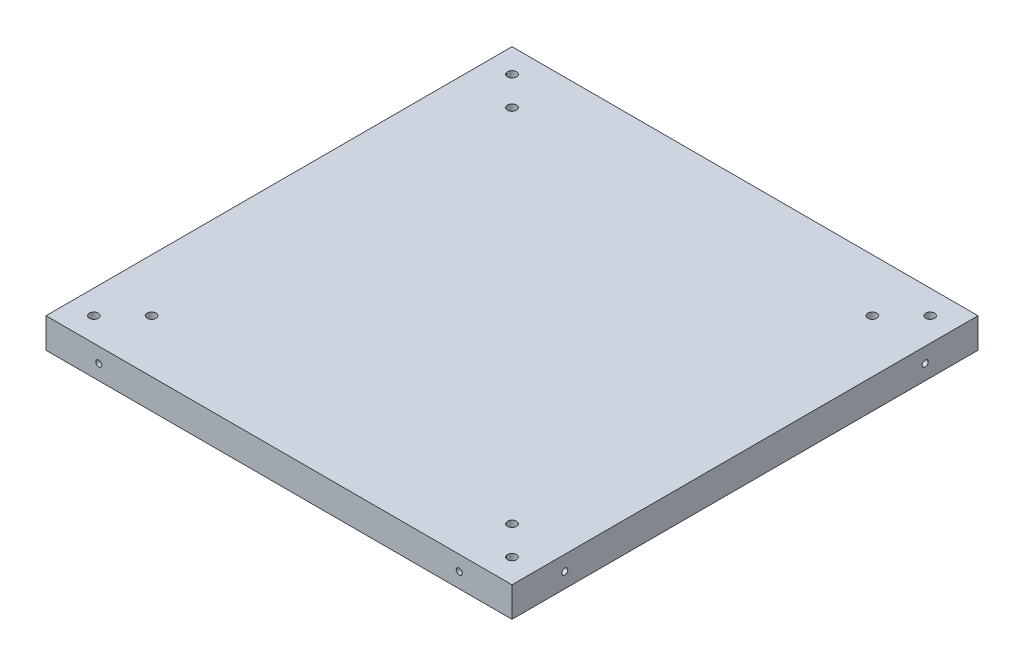
ISO-10303-21;
HEADER;
FILE_DESCRIPTION(('STEP AP214'),'2;1');
FILE_NAME('part.step','',(''),(''),'','','');
FILE_SCHEMA(('AUTOMOTIVE_DESIGN { 1 0 10303 214 1 1 1 1 }'));
ENDSEC;
DATA;
#1=APPLICATION_CONTEXT('core data for automotive mechanical design processes');
#2=APPLICATION_PROTOCOL_DEFINITION('international standard','automotive_design',2000,#1);
#3=PRODUCT_CONTEXT('',#1,'mechanical');
#4=PRODUCT('Part','Part','',(#3));
#5=PRODUCT_RELATED_PRODUCT_CATEGORY('part','',(#4));
#6=PRODUCT_DEFINITION_FORMATION('','',#4);
#7=PRODUCT_DEFINITION_CONTEXT('part definition',#1,'design');
#8=PRODUCT_DEFINITION('design','',#6,#7);
#9=PRODUCT_DEFINITION_SHAPE('','',#8);
#10=(LENGTH_UNIT() NAMED_UNIT(*) SI_UNIT(.MILLI.,.METRE.));
#11=(NAMED_UNIT(*) PLANE_ANGLE_UNIT() SI_UNIT($,.RADIAN.));
#12=(NAMED_UNIT(*) SI_UNIT($,.STERADIAN.) SOLID_ANGLE_UNIT());
#13=UNCERTAINTY_MEASURE_WITH_UNIT(LENGTH_MEASURE(1.E-05),#10,'distance_accuracy_value','');
#14=(GEOMETRIC_REPRESENTATION_CONTEXT(3) GLOBAL_UNCERTAINTY_ASSIGNED_CONTEXT((#13)) GLOBAL_UNIT_ASSIGNED_CONTEXT((#10,
#11,#12)) REPRESENTATION_CONTEXT('',''));
#15=CARTESIAN_POINT('',(0.,0.,0.));
#16=DIRECTION('',(0.,0.,1.));
#17=DIRECTION('',(1.,0.,0.));
#18=AXIS2_PLACEMENT_3D('',#15,#16,#17);
#19=CARTESIAN_POINT('',(-60.6043265364737,20.,60.474138119506));
#20=DIRECTION('',(0.,-1.,0.));
#21=DIRECTION('',(0.,0.,-1.));
#22=AXIS2_PLACEMENT_3D('',#19,#20,#21);
#23=CYLINDRICAL_SURFACE('',#22,1.5);
#24=CARTESIAN_POINT('',(-60.6043265364737,3.,60.474138119506));
#25=DIRECTION('',(0.,-1.,0.));
#26=DIRECTION('',(0.,0.,-1.));
#27=AXIS2_PLACEMENT_3D('',#24,#25,#26);
#28=CIRCLE('',#27,1.5);
#29=CARTESIAN_POINT('',(-60.6043265364737,3.,58.974138119506));
#30=VERTEX_POINT('',#29);
#31=EDGE_CURVE('E48',#30,#30,#28,.T.);
#32=ORIENTED_EDGE('',*,*,#31,.T.);
#33=EDGE_LOOP('',(#32));
#34=FACE_BOUND('',#33,.T.);
#35=CARTESIAN_POINT('',(-60.6043265364737,10.,60.474138119506));
#36=DIRECTION('',(0.,1.,0.));
#37=DIRECTION('',(0.,0.,1.));
#38=AXIS2_PLACEMENT_3D('',#35,#36,#37);
#39=CIRCLE('',#38,1.5);
#40=CARTESIAN_POINT('',(-60.6043265364737,10.,61.974138119506));
#41=VERTEX_POINT('',#40);
#42=EDGE_CURVE('E249',#41,#41,#39,.T.);
#43=ORIENTED_EDGE('',*,*,#42,.T.);
#44=EDGE_LOOP('',(#43));
#45=FACE_BOUND('',#44,.T.);
#46=ADVANCED_FACE('F44',(#34,#45),#23,.F.);
#47=CARTESIAN_POINT('',(-60.6043265364737,20.,-59.9533844516352));
#48=DIRECTION('',(0.,-1.,0.));
#49=DIRECTION('',(0.,0.,-1.));
#50=AXIS2_PLACEMENT_3D('',#47,#48,#49);
#51=CYLINDRICAL_SURFACE('',#50,1.5);
#52=CARTESIAN_POINT('',(-60.6043265364737,3.,-59.9533844516352));
#53=DIRECTION('',(0.,-1.,0.));
#54=DIRECTION('',(0.,0.,-1.));
#55=AXIS2_PLACEMENT_3D('',#52,#53,#54);
#56=CIRCLE('',#55,1.5);
#57=CARTESIAN_POINT('',(-60.6043265364737,3.,-61.4533844516352));
#58=VERTEX_POINT('',#57);
#59=EDGE_CURVE('E127',#58,#58,#56,.T.);
#60=ORIENTED_EDGE('',*,*,#59,.T.);
#61=EDGE_LOOP('',(#60));
#62=FACE_BOUND('',#61,.T.);
#63=CARTESIAN_POINT('',(-60.6043265364737,10.,-59.9533844516352));
#64=DIRECTION('',(0.,1.,0.));
#65=DIRECTION('',(0.,0.,1.));
#66=AXIS2_PLACEMENT_3D('',#63,#64,#65);
#67=CIRCLE('',#66,1.5);
#68=CARTESIAN_POINT('',(-60.6043265364737,10.,-58.4533844516352));
#69=VERTEX_POINT('',#68);
#70=EDGE_CURVE('E246',#69,#69,#67,.T.);
#71=ORIENTED_EDGE('',*,*,#70,.T.);
#72=EDGE_LOOP('',(#71));
#73=FACE_BOUND('',#72,.T.);
#74=ADVANCED_FACE('F174',(#62,#73),#51,.F.);
#75=CARTESIAN_POINT('',(59.8231960346675,20.,-59.9533844516352));
#76=DIRECTION('',(0.,-1.,0.));
#77=DIRECTION('',(0.,0.,-1.));
#78=AXIS2_PLACEMENT_3D('',#75,#76,#77);
#79=CYLINDRICAL_SURFACE('',#78,1.5);
#80=CARTESIAN_POINT('',(59.8231960346675,3.,-59.9533844516352));
#81=DIRECTION('',(0.,-1.,0.));
#82=DIRECTION('',(0.,0.,-1.));
#83=AXIS2_PLACEMENT_3D('',#80,#81,#82);
#84=CIRCLE('',#83,1.5);
#85=CARTESIAN_POINT('',(59.8231960346675,3.,-61.4533844516352));
#86=VERTEX_POINT('',#85);
#87=EDGE_CURVE('E124',#86,#86,#84,.T.);
#88=ORIENTED_EDGE('',*,*,#87,.T.);
#89=EDGE_LOOP('',(#88));
#90=FACE_BOUND('',#89,.T.);
#91=CARTESIAN_POINT('',(59.8231960346675,10.,-59.9533844516352));
#92=DIRECTION('',(0.,1.,0.));
#93=DIRECTION('',(0.,0.,1.));
#94=AXIS2_PLACEMENT_3D('',#91,#92,#93);
#95=CIRCLE('',#94,1.5);
#96=CARTESIAN_POINT('',(59.8231960346675,10.,-58.4533844516352));
#97=VERTEX_POINT('',#96);
#98=EDGE_CURVE('E243',#97,#97,#95,.T.);
#99=ORIENTED_EDGE('',*,*,#98,.T.);
#100=EDGE_LOOP('',(#99));
#101=FACE_BOUND('',#100,.T.);
#102=ADVANCED_FACE('F179',(#90,#101),#79,.F.);
#103=CARTESIAN_POINT('',(59.8231960346675,20.,60.474138119506));
#104=DIRECTION('',(0.,-1.,0.));
#105=DIRECTION('',(0.,0.,-1.));
#106=AXIS2_PLACEMENT_3D('',#103,#104,#105);
#107=CYLINDRICAL_SURFACE('',#106,1.5);
#108=CARTESIAN_POINT('',(59.8231960346675,3.,60.474138119506));
#109=DIRECTION('',(0.,-1.,0.));
#110=DIRECTION('',(0.,0.,-1.));
#111=AXIS2_PLACEMENT_3D('',#108,#109,#110);
#112=CIRCLE('',#111,1.5);
#113=CARTESIAN_POINT('',(59.8231960346675,3.,58.974138119506));
#114=VERTEX_POINT('',#113);
#115=EDGE_CURVE('E121',#114,#114,#112,.T.);
#116=ORIENTED_EDGE('',*,*,#115,.T.);
#117=EDGE_LOOP('',(#116));
#118=FACE_BOUND('',#117,.T.);
#119=CARTESIAN_POINT('',(59.8231960346675,10.,60.474138119506));
#120=DIRECTION('',(0.,1.,0.));
#121=DIRECTION('',(0.,0.,1.));
#122=AXIS2_PLACEMENT_3D('',#119,#120,#121);
#123=CIRCLE('',#122,1.5);
#124=CARTESIAN_POINT('',(59.8231960346675,10.,61.974138119506));
#125=VERTEX_POINT('',#124);
#126=EDGE_CURVE('E245',#125,#125,#123,.T.);
#127=ORIENTED_EDGE('',*,*,#126,.T.);
#128=EDGE_LOOP('',(#127));
#129=FACE_BOUND('',#128,.T.);
#130=ADVANCED_FACE('F185',(#118,#129),#107,.F.);
#131=CARTESIAN_POINT('',(74.4472356279509,0.,75.0981777127893));
#132=DIRECTION('',(0.,1.,0.));
#133=DIRECTION('',(0.,0.,1.));
#134=AXIS2_PLACEMENT_3D('',#131,#132,#133);
#135=PLANE('',#134);
#136=CARTESIAN_POINT('',(59.8231960346675,0.,60.474138119506));
#137=DIRECTION('',(0.,-1.,0.));
#138=DIRECTION('',(0.,0.,-1.));
#139=AXIS2_PLACEMENT_3D('',#136,#137,#138);
#140=CIRCLE('',#139,3.00000000000001);
#141=CARTESIAN_POINT('',(59.8231960346675,0.,57.4741381195059));
#142=VERTEX_POINT('',#141);
#143=EDGE_CURVE('E197',#142,#142,#140,.T.);
#144=ORIENTED_EDGE('',*,*,#143,.F.);
#145=EDGE_LOOP('',(#144));
#146=FACE_BOUND('',#145,.T.);
#147=CARTESIAN_POINT('',(-60.6043265364737,0.,60.474138119506));
#148=DIRECTION('',(0.,-1.,0.));
#149=DIRECTION('',(0.,0.,-1.));
#150=AXIS2_PLACEMENT_3D('',#147,#148,#149);
#151=CIRCLE('',#150,3.);
#152=CARTESIAN_POINT('',(-60.6043265364737,0.,57.474138119506));
#153=VERTEX_POINT('',#152);
#154=EDGE_CURVE('E201',#153,#153,#151,.T.);
#155=ORIENTED_EDGE('',*,*,#154,.F.);
#156=EDGE_LOOP('',(#155));
#157=FACE_BOUND('',#156,.T.);
#158=CARTESIAN_POINT('',(-60.6043265364737,0.,-59.9533844516352));
#159=DIRECTION('',(0.,-1.,0.));
#160=DIRECTION('',(0.,0.,-1.));
#161=AXIS2_PLACEMENT_3D('',#158,#159,#160);
#162=CIRCLE('',#161,3.);
#163=CARTESIAN_POINT('',(-60.6043265364737,0.,-62.9533844516352));
#164=VERTEX_POINT('',#163);
#165=EDGE_CURVE('E205',#164,#164,#162,.T.);
#166=ORIENTED_EDGE('',*,*,#165,.F.);
#167=EDGE_LOOP('',(#166));
#168=FACE_BOUND('',#167,.T.);
#169=CARTESIAN_POINT('',(59.8231960346675,0.,-59.9533844516352));
#170=DIRECTION('',(0.,-1.,0.));
#171=DIRECTION('',(0.,0.,-1.));
#172=AXIS2_PLACEMENT_3D('',#169,#170,#171);
#173=CIRCLE('',#172,3.00000000000001);
#174=CARTESIAN_POINT('',(59.8231960346675,0.,-62.9533844516352));
#175=VERTEX_POINT('',#174);
#176=EDGE_CURVE('E209',#175,#175,#173,.T.);
#177=ORIENTED_EDGE('',*,*,#176,.F.);
#178=EDGE_LOOP('',(#177));
#179=FACE_BOUND('',#178,.T.);
#180=CARTESIAN_POINT('',(-70.2419688497109,0.,70.1117804327432));
#181=DIRECTION('',(0.,1.,0.));
#182=DIRECTION('',(0.,0.,1.));
#183=AXIS2_PLACEMENT_3D('',#180,#181,#182);
#184=CIRCLE('',#183,1.5);
#185=CARTESIAN_POINT('',(-70.2419688497109,0.,71.6117804327432));
#186=VERTEX_POINT('',#185);
#187=EDGE_CURVE('E111',#186,#186,#184,.T.);
#188=ORIENTED_EDGE('',*,*,#187,.T.);
#189=EDGE_LOOP('',(#188));
#190=FACE_BOUND('',#189,.T.);
#191=CARTESIAN_POINT('',(69.4608383479047,0.,70.1117804327432));
#192=DIRECTION('',(0.,1.,0.));
#193=DIRECTION('',(0.,0.,1.));
#194=AXIS2_PLACEMENT_3D('',#191,#192,#193);
#195=CIRCLE('',#194,1.5);
#196=CARTESIAN_POINT('',(69.4608383479047,0.,71.6117804327432));
#197=VERTEX_POINT('',#196);
#198=EDGE_CURVE('E154',#197,#197,#195,.T.);
#199=ORIENTED_EDGE('',*,*,#198,.T.);
#200=EDGE_LOOP('',(#199));
#201=FACE_BOUND('',#200,.T.);
#202=CARTESIAN_POINT('',(69.4608383479047,0.,-69.5910267648724));
#203=DIRECTION('',(0.,1.,0.));
#204=DIRECTION('',(0.,0.,1.));
#205=AXIS2_PLACEMENT_3D('',#202,#203,#204);
#206=CIRCLE('',#205,1.5);
#207=CARTESIAN_POINT('',(69.4608383479047,0.,-68.0910267648724));
#208=VERTEX_POINT('',#207);
#209=EDGE_CURVE('E151',#208,#208,#206,.T.);
#210=ORIENTED_EDGE('',*,*,#209,.T.);
#211=EDGE_LOOP('',(#210));
#212=FACE_BOUND('',#211,.T.);
#213=CARTESIAN_POINT('',(-70.2419688497109,0.,-69.5910267648724));
#214=DIRECTION('',(0.,1.,0.));
#215=DIRECTION('',(0.,0.,1.));
#216=AXIS2_PLACEMENT_3D('',#213,#214,#215);
#217=CIRCLE('',#216,1.5);
#218=CARTESIAN_POINT('',(-70.2419688497109,0.,-68.0910267648724));
#219=VERTEX_POINT('',#218);
#220=EDGE_CURVE('E148',#219,#219,#217,.T.);
#221=ORIENTED_EDGE('',*,*,#220,.T.);
#222=EDGE_LOOP('',(#221));
#223=FACE_BOUND('',#222,.T.);
#224=DIRECTION('',(0.,0.,-1.));
#225=VECTOR('',#224,1.);
#226=CARTESIAN_POINT('',(77.4608383479047,0.,75.0981777127893));
#227=LINE('',#226,#225);
#228=CARTESIAN_POINT('',(77.4608383479047,0.,78.1117804327432));
#229=VERTEX_POINT('',#228);
#230=CARTESIAN_POINT('',(77.4608383479047,0.,-77.5910267648724));
#231=VERTEX_POINT('',#230);
#232=EDGE_CURVE('E91',#229,#231,#227,.T.);
#233=ORIENTED_EDGE('',*,*,#232,.F.);
#234=DIRECTION('',(1.,0.,0.));
#235=VECTOR('',#234,1.);
#236=CARTESIAN_POINT('',(-75.228366129757,0.,78.1117804327432));
#237=LINE('',#236,#235);
#238=CARTESIAN_POINT('',(-78.2419688497109,0.,78.1117804327432));
#239=VERTEX_POINT('',#238);
#240=EDGE_CURVE('E11',#239,#229,#237,.T.);
#241=ORIENTED_EDGE('',*,*,#240,.F.);
#242=DIRECTION('',(0.,0.,1.));
#243=VECTOR('',#242,1.);
#244=CARTESIAN_POINT('',(-78.2419688497109,0.,-74.5774240449186));
#245=LINE('',#244,#243);
#246=CARTESIAN_POINT('',(-78.2419688497109,0.,-77.5910267648724));
#247=VERTEX_POINT('',#246);
#248=EDGE_CURVE('E54',#247,#239,#245,.T.);
#249=ORIENTED_EDGE('',*,*,#248,.F.);
#250=DIRECTION('',(-1.,0.,0.));
#251=VECTOR('',#250,1.);
#252=CARTESIAN_POINT('',(74.4472356279509,0.,-77.5910267648724));
#253=LINE('',#252,#251);
#254=EDGE_CURVE('E63',#231,#247,#253,.T.);
#255=ORIENTED_EDGE('',*,*,#254,.F.);
#256=EDGE_LOOP('',(#233,#241,#249,#255));
#257=FACE_BOUND('',#256,.T.);
#258=ADVANCED_FACE('F92',(#146,#157,#168,#179,#190,#201,#212,#223,#257),#135,.F.);
#259=CARTESIAN_POINT('',(77.4608383479047,20.,75.0981777127893));
#260=DIRECTION('',(-1.,0.,0.));
#261=DIRECTION('',(0.,0.,1.));
#262=AXIS2_PLACEMENT_3D('',#259,#260,#261);
#263=PLANE('',#262);
#264=CARTESIAN_POINT('',(77.4608383479047,4.99999999999999,-59.9533844516352));
#265=DIRECTION('',(1.,0.,0.));
#266=DIRECTION('',(0.,0.,-1.));
#267=AXIS2_PLACEMENT_3D('',#264,#265,#266);
#268=CIRCLE('',#267,0.999999999999984);
#269=CARTESIAN_POINT('',(77.4608383479047,4.99999999999999,-60.9533844516352));
#270=VERTEX_POINT('',#269);
#271=EDGE_CURVE('E737',#270,#270,#268,.T.);
#272=ORIENTED_EDGE('',*,*,#271,.F.);
#273=EDGE_LOOP('',(#272));
#274=FACE_BOUND('',#273,.T.);
#275=CARTESIAN_POINT('',(77.4608383479047,4.99999999999999,60.474138119506));
#276=DIRECTION('',(1.,0.,0.));
#277=DIRECTION('',(0.,0.,-1.));
#278=AXIS2_PLACEMENT_3D('',#275,#276,#277);
#279=CIRCLE('',#278,0.999999999999998);
#280=CARTESIAN_POINT('',(77.4608383479047,4.99999999999999,59.474138119506));
#281=VERTEX_POINT('',#280);
#282=EDGE_CURVE('E748',#281,#281,#279,.T.);
#283=ORIENTED_EDGE('',*,*,#282,.F.);
#284=EDGE_LOOP('',(#283));
#285=FACE_BOUND('',#284,.T.);
#286=ORIENTED_EDGE('',*,*,#232,.T.);
#287=DIRECTION('',(0.,1.,0.));
#288=VECTOR('',#287,1.);
#289=CARTESIAN_POINT('',(77.4608383479047,0.,-77.5910267648724));
#290=LINE('',#289,#288);
#291=CARTESIAN_POINT('',(77.4608383479047,10.,-77.5910267648724));
#292=VERTEX_POINT('',#291);
#293=EDGE_CURVE('E107',#231,#292,#290,.T.);
#294=ORIENTED_EDGE('',*,*,#293,.T.);
#295=DIRECTION('',(0.,0.,-1.));
#296=VECTOR('',#295,1.);
#297=CARTESIAN_POINT('',(77.4608383479047,10.,75.0981777127893));
#298=LINE('',#297,#296);
#299=CARTESIAN_POINT('',(77.4608383479047,10.,78.1117804327432));
#300=VERTEX_POINT('',#299);
#301=EDGE_CURVE('E105',#300,#292,#298,.T.);
#302=ORIENTED_EDGE('',*,*,#301,.F.);
#303=DIRECTION('',(0.,1.,0.));
#304=VECTOR('',#303,1.);
#305=CARTESIAN_POINT('',(77.4608383479047,0.,78.1117804327432));
#306=LINE('',#305,#304);
#307=EDGE_CURVE('E103',#229,#300,#306,.T.);
#308=ORIENTED_EDGE('',*,*,#307,.F.);
#309=EDGE_LOOP('',(#286,#294,#302,#308));
#310=FACE_BOUND('',#309,.T.);
#311=ADVANCED_FACE('F46',(#274,#285,#310),#263,.F.);
#312=CARTESIAN_POINT('',(74.4472356279509,20.,-77.5910267648724));
#313=DIRECTION('',(0.,0.,1.));
#314=DIRECTION('',(1.,0.,0.));
#315=AXIS2_PLACEMENT_3D('',#312,#313,#314);
#316=PLANE('',#315);
#317=CARTESIAN_POINT('',(59.8231960346675,4.99999999999999,-77.5910267648724));
#318=DIRECTION('',(0.,0.,-1.));
#319=DIRECTION('',(-1.,0.,0.));
#320=AXIS2_PLACEMENT_3D('',#317,#318,#319);
#321=CIRCLE('',#320,0.999999999999998);
#322=CARTESIAN_POINT('',(58.8231960346675,4.99999999999999,-77.5910267648724));
#323=VERTEX_POINT('',#322);
#324=EDGE_CURVE('E774',#323,#323,#321,.T.);
#325=ORIENTED_EDGE('',*,*,#324,.F.);
#326=EDGE_LOOP('',(#325));
#327=FACE_BOUND('',#326,.T.);
#328=CARTESIAN_POINT('',(-60.6043265364737,4.99999999999999,-77.5910267648724));
#329=DIRECTION('',(0.,0.,-1.));
#330=DIRECTION('',(-1.,0.,0.));
#331=AXIS2_PLACEMENT_3D('',#328,#329,#330);
#332=CIRCLE('',#331,0.999999999999998);
#333=CARTESIAN_POINT('',(-61.6043265364737,4.99999999999999,-77.5910267648724));
#334=VERTEX_POINT('',#333);
#335=EDGE_CURVE('E763',#334,#334,#332,.T.);
#336=ORIENTED_EDGE('',*,*,#335,.F.);
#337=EDGE_LOOP('',(#336));
#338=FACE_BOUND('',#337,.T.);
#339=ORIENTED_EDGE('',*,*,#254,.T.);
#340=DIRECTION('',(0.,1.,0.));
#341=VECTOR('',#340,1.);
#342=CARTESIAN_POINT('',(-78.2419688497109,0.,-77.5910267648724));
#343=LINE('',#342,#341);
#344=CARTESIAN_POINT('',(-78.2419688497109,10.,-77.5910267648724));
#345=VERTEX_POINT('',#344);
#346=EDGE_CURVE('E109',#247,#345,#343,.T.);
#347=ORIENTED_EDGE('',*,*,#346,.T.);
#348=DIRECTION('',(-1.,0.,0.));
#349=VECTOR('',#348,1.);
#350=CARTESIAN_POINT('',(74.4472356279509,10.,-77.5910267648724));
#351=LINE('',#350,#349);
#352=EDGE_CURVE('E78',#292,#345,#351,.T.);
#353=ORIENTED_EDGE('',*,*,#352,.F.);
#354=ORIENTED_EDGE('',*,*,#293,.F.);
#355=EDGE_LOOP('',(#339,#347,#353,#354));
#356=FACE_BOUND('',#355,.T.);
#357=ADVANCED_FACE('F158',(#327,#338,#356),#316,.F.);
#358=CARTESIAN_POINT('',(-78.2419688497109,20.,-74.5774240449186));
#359=DIRECTION('',(1.,0.,0.));
#360=DIRECTION('',(0.,0.,-1.));
#361=AXIS2_PLACEMENT_3D('',#358,#359,#360);
#362=PLANE('',#361);
#363=CARTESIAN_POINT('',(-78.2419688497109,4.99999999999999,-59.9533844516352));
#364=DIRECTION('',(-1.,0.,0.));
#365=DIRECTION('',(0.,0.,1.));
#366=AXIS2_PLACEMENT_3D('',#363,#364,#365);
#367=CIRCLE('',#366,0.999999999999985);
#368=CARTESIAN_POINT('',(-78.2419688497109,4.99999999999999,-58.9533844516352));
#369=VERTEX_POINT('',#368);
#370=EDGE_CURVE('E764',#369,#369,#367,.T.);
#371=ORIENTED_EDGE('',*,*,#370,.F.);
#372=EDGE_LOOP('',(#371));
#373=FACE_BOUND('',#372,.T.);
#374=CARTESIAN_POINT('',(-78.2419688497109,4.99999999999999,60.474138119506));
#375=DIRECTION('',(-1.,0.,0.));
#376=DIRECTION('',(0.,0.,1.));
#377=AXIS2_PLACEMENT_3D('',#374,#375,#376);
#378=CIRCLE('',#377,0.999999999999998);
#379=CARTESIAN_POINT('',(-78.2419688497109,4.99999999999999,61.474138119506));
#380=VERTEX_POINT('',#379);
#381=EDGE_CURVE('E754',#380,#380,#378,.T.);
#382=ORIENTED_EDGE('',*,*,#381,.F.);
#383=EDGE_LOOP('',(#382));
#384=FACE_BOUND('',#383,.T.);
#385=ORIENTED_EDGE('',*,*,#248,.T.);
#386=DIRECTION('',(0.,1.,0.));
#387=VECTOR('',#386,1.);
#388=CARTESIAN_POINT('',(-78.2419688497109,0.,78.1117804327432));
#389=LINE('',#388,#387);
#390=CARTESIAN_POINT('',(-78.2419688497109,10.,78.1117804327432));
#391=VERTEX_POINT('',#390);
#392=EDGE_CURVE('E104',#239,#391,#389,.T.);
#393=ORIENTED_EDGE('',*,*,#392,.T.);
#394=DIRECTION('',(0.,0.,1.));
#395=VECTOR('',#394,1.);
#396=CARTESIAN_POINT('',(-78.2419688497109,10.,-74.5774240449186));
#397=LINE('',#396,#395);
#398=EDGE_CURVE('E85',#345,#391,#397,.T.);
#399=ORIENTED_EDGE('',*,*,#398,.F.);
#400=ORIENTED_EDGE('',*,*,#346,.F.);
#401=EDGE_LOOP('',(#385,#393,#399,#400));
#402=FACE_BOUND('',#401,.T.);
#403=ADVANCED_FACE('F159',(#373,#384,#402),#362,.F.);
#404=CARTESIAN_POINT('',(-75.228366129757,20.,78.1117804327432));
#405=DIRECTION('',(0.,0.,-1.));
#406=DIRECTION('',(-1.,0.,0.));
#407=AXIS2_PLACEMENT_3D('',#404,#405,#406);
#408=PLANE('',#407);
#409=CARTESIAN_POINT('',(-60.6043265364737,4.99999999999999,78.1117804327432));
#410=DIRECTION('',(0.,0.,1.));
#411=DIRECTION('',(1.,0.,0.));
#412=AXIS2_PLACEMENT_3D('',#409,#410,#411);
#413=CIRCLE('',#412,0.999999999999998);
#414=CARTESIAN_POINT('',(-59.6043265364737,4.99999999999999,78.1117804327432));
#415=VERTEX_POINT('',#414);
#416=EDGE_CURVE('E755',#415,#415,#413,.T.);
#417=ORIENTED_EDGE('',*,*,#416,.F.);
#418=EDGE_LOOP('',(#417));
#419=FACE_BOUND('',#418,.T.);
#420=CARTESIAN_POINT('',(59.8231960346675,4.99999999999999,78.1117804327432));
#421=DIRECTION('',(0.,0.,1.));
#422=DIRECTION('',(1.,0.,0.));
#423=AXIS2_PLACEMENT_3D('',#420,#421,#422);
#424=CIRCLE('',#423,0.999999999999998);
#425=CARTESIAN_POINT('',(60.8231960346675,4.99999999999999,78.1117804327432));
#426=VERTEX_POINT('',#425);
#427=EDGE_CURVE('E736',#426,#426,#424,.T.);
#428=ORIENTED_EDGE('',*,*,#427,.F.);
#429=EDGE_LOOP('',(#428));
#430=FACE_BOUND('',#429,.T.);
#431=ORIENTED_EDGE('',*,*,#240,.T.);
#432=ORIENTED_EDGE('',*,*,#307,.T.);
#433=DIRECTION('',(1.,0.,0.));
#434=VECTOR('',#433,1.);
#435=CARTESIAN_POINT('',(-75.228366129757,10.,78.1117804327432));
#436=LINE('',#435,#434);
#437=EDGE_CURVE('E97',#391,#300,#436,.T.);
#438=ORIENTED_EDGE('',*,*,#437,.F.);
#439=ORIENTED_EDGE('',*,*,#392,.F.);
#440=EDGE_LOOP('',(#431,#432,#438,#439));
#441=FACE_BOUND('',#440,.T.);
#442=ADVANCED_FACE('F101',(#419,#430,#441),#408,.F.);
#443=CARTESIAN_POINT('',(0.,10.,0.));
#444=DIRECTION('',(0.,-1.,0.));
#445=DIRECTION('',(0.,0.,-1.));
#446=AXIS2_PLACEMENT_3D('',#443,#444,#445);
#447=PLANE('',#446);
#448=CARTESIAN_POINT('',(-70.2419688497109,10.,70.1117804327432));
#449=DIRECTION('',(0.,1.,0.));
#450=DIRECTION('',(0.,0.,-1.));
#451=AXIS2_PLACEMENT_3D('',#448,#449,#450);
#452=CIRCLE('',#451,1.5);
#453=CARTESIAN_POINT('',(-70.2419688497109,10.,68.6117804327432));
#454=VERTEX_POINT('',#453);
#455=EDGE_CURVE('E132',#454,#454,#452,.T.);
#456=ORIENTED_EDGE('',*,*,#455,.F.);
#457=EDGE_LOOP('',(#456));
#458=FACE_BOUND('',#457,.T.);
#459=CARTESIAN_POINT('',(69.4608383479047,10.,70.1117804327432));
#460=DIRECTION('',(0.,1.,0.));
#461=DIRECTION('',(0.,0.,1.));
#462=AXIS2_PLACEMENT_3D('',#459,#460,#461);
#463=CIRCLE('',#462,1.5);
#464=CARTESIAN_POINT('',(69.4608383479047,10.,71.6117804327432));
#465=VERTEX_POINT('',#464);
#466=EDGE_CURVE('E136',#465,#465,#463,.T.);
#467=ORIENTED_EDGE('',*,*,#466,.F.);
#468=EDGE_LOOP('',(#467));
#469=FACE_BOUND('',#468,.T.);
#470=CARTESIAN_POINT('',(69.4608383479047,10.,-69.5910267648724));
#471=DIRECTION('',(0.,1.,0.));
#472=DIRECTION('',(0.,0.,-1.));
#473=AXIS2_PLACEMENT_3D('',#470,#471,#472);
#474=CIRCLE('',#473,1.5);
#475=CARTESIAN_POINT('',(69.4608383479047,10.,-71.0910267648724));
#476=VERTEX_POINT('',#475);
#477=EDGE_CURVE('E141',#476,#476,#474,.T.);
#478=ORIENTED_EDGE('',*,*,#477,.F.);
#479=EDGE_LOOP('',(#478));
#480=FACE_BOUND('',#479,.T.);
#481=CARTESIAN_POINT('',(-70.2419688497109,10.,-69.5910267648724));
#482=DIRECTION('',(0.,1.,0.));
#483=DIRECTION('',(0.,0.,1.));
#484=AXIS2_PLACEMENT_3D('',#481,#482,#483);
#485=CIRCLE('',#484,1.5);
#486=CARTESIAN_POINT('',(-70.2419688497109,10.,-68.0910267648724));
#487=VERTEX_POINT('',#486);
#488=EDGE_CURVE('E145',#487,#487,#485,.T.);
#489=ORIENTED_EDGE('',*,*,#488,.F.);
#490=EDGE_LOOP('',(#489));
#491=FACE_BOUND('',#490,.T.);
#492=ORIENTED_EDGE('',*,*,#437,.T.);
#493=ORIENTED_EDGE('',*,*,#301,.T.);
#494=ORIENTED_EDGE('',*,*,#352,.T.);
#495=ORIENTED_EDGE('',*,*,#398,.T.);
#496=EDGE_LOOP('',(#492,#493,#494,#495));
#497=FACE_BOUND('',#496,.T.);
#498=ORIENTED_EDGE('',*,*,#42,.F.);
#499=EDGE_LOOP('',(#498));
#500=FACE_BOUND('',#499,.T.);
#501=ORIENTED_EDGE('',*,*,#126,.F.);
#502=EDGE_LOOP('',(#501));
#503=FACE_BOUND('',#502,.T.);
#504=ORIENTED_EDGE('',*,*,#98,.F.);
#505=EDGE_LOOP('',(#504));
#506=FACE_BOUND('',#505,.T.);
#507=ORIENTED_EDGE('',*,*,#70,.F.);
#508=EDGE_LOOP('',(#507));
#509=FACE_BOUND('',#508,.T.);
#510=ADVANCED_FACE('F167',(#458,#469,#480,#491,#497,#500,#503,#506,#509),#447,.F.);
#511=CARTESIAN_POINT('',(-70.2419688497109,-48.,-69.5910267648724));
#512=DIRECTION('',(0.,1.,0.));
#513=DIRECTION('',(0.,0.,1.));
#514=AXIS2_PLACEMENT_3D('',#511,#512,#513);
#515=CYLINDRICAL_SURFACE('',#514,1.5);
#516=ORIENTED_EDGE('',*,*,#488,.T.);
#517=EDGE_LOOP('',(#516));
#518=FACE_BOUND('',#517,.T.);
#519=ORIENTED_EDGE('',*,*,#220,.F.);
#520=EDGE_LOOP('',(#519));
#521=FACE_BOUND('',#520,.T.);
#522=ADVANCED_FACE('F218',(#518,#521),#515,.F.);
#523=CARTESIAN_POINT('',(69.4608383479047,-48.,-69.5910267648724));
#524=DIRECTION('',(0.,1.,0.));
#525=DIRECTION('',(0.,0.,1.));
#526=AXIS2_PLACEMENT_3D('',#523,#524,#525);
#527=CYLINDRICAL_SURFACE('',#526,1.5);
#528=ORIENTED_EDGE('',*,*,#477,.T.);
#529=EDGE_LOOP('',(#528));
#530=FACE_BOUND('',#529,.T.);
#531=ORIENTED_EDGE('',*,*,#209,.F.);
#532=EDGE_LOOP('',(#531));
#533=FACE_BOUND('',#532,.T.);
#534=ADVANCED_FACE('F220',(#530,#533),#527,.F.);
#535=CARTESIAN_POINT('',(69.4608383479047,-48.,70.1117804327432));
#536=DIRECTION('',(0.,1.,0.));
#537=DIRECTION('',(0.,0.,1.));
#538=AXIS2_PLACEMENT_3D('',#535,#536,#537);
#539=CYLINDRICAL_SURFACE('',#538,1.5);
#540=ORIENTED_EDGE('',*,*,#466,.T.);
#541=EDGE_LOOP('',(#540));
#542=FACE_BOUND('',#541,.T.);
#543=ORIENTED_EDGE('',*,*,#198,.F.);
#544=EDGE_LOOP('',(#543));
#545=FACE_BOUND('',#544,.T.);
#546=ADVANCED_FACE('F227',(#542,#545),#539,.F.);
#547=CARTESIAN_POINT('',(-70.2419688497109,-48.,70.1117804327432));
#548=DIRECTION('',(0.,1.,0.));
#549=DIRECTION('',(0.,0.,1.));
#550=AXIS2_PLACEMENT_3D('',#547,#548,#549);
#551=CYLINDRICAL_SURFACE('',#550,1.5);
#552=ORIENTED_EDGE('',*,*,#455,.T.);
#553=EDGE_LOOP('',(#552));
#554=FACE_BOUND('',#553,.T.);
#555=ORIENTED_EDGE('',*,*,#187,.F.);
#556=EDGE_LOOP('',(#555));
#557=FACE_BOUND('',#556,.T.);
#558=ADVANCED_FACE('F233',(#554,#557),#551,.F.);
#559=CARTESIAN_POINT('',(59.8231960346675,3.,-59.9533844516352));
#560=DIRECTION('',(0.,-1.,0.));
#561=DIRECTION('',(0.,0.,-1.));
#562=AXIS2_PLACEMENT_3D('',#559,#560,#561);
#563=CYLINDRICAL_SURFACE('',#562,3.00000000000001);
#564=CARTESIAN_POINT('',(59.8231960346675,3.,-59.9533844516352));
#565=DIRECTION('',(0.,-1.,0.));
#566=DIRECTION('',(0.,0.,-1.));
#567=AXIS2_PLACEMENT_3D('',#564,#565,#566);
#568=CIRCLE('',#567,3.00000000000001);
#569=CARTESIAN_POINT('',(59.8231960346675,3.,-62.9533844516352));
#570=VERTEX_POINT('',#569);
#571=EDGE_CURVE('E125',#570,#570,#568,.T.);
#572=ORIENTED_EDGE('',*,*,#571,.F.);
#573=EDGE_LOOP('',(#572));
#574=FACE_BOUND('',#573,.T.);
#575=ORIENTED_EDGE('',*,*,#176,.T.);
#576=EDGE_LOOP('',(#575));
#577=FACE_BOUND('',#576,.T.);
#578=ADVANCED_FACE('F288',(#574,#577),#563,.F.);
#579=CARTESIAN_POINT('',(59.8231960346675,3.,-59.9533844516352));
#580=DIRECTION('',(0.,-1.,0.));
#581=DIRECTION('',(0.,0.,-1.));
#582=AXIS2_PLACEMENT_3D('',#579,#580,#581);
#583=PLANE('',#582);
#584=ORIENTED_EDGE('',*,*,#87,.F.);
#585=EDGE_LOOP('',(#584));
#586=FACE_BOUND('',#585,.T.);
#587=ORIENTED_EDGE('',*,*,#571,.T.);
#588=EDGE_LOOP('',(#587));
#589=FACE_BOUND('',#588,.T.);
#590=ADVANCED_FACE('F290',(#586,#589),#583,.T.);
#591=CARTESIAN_POINT('',(-60.6043265364737,3.,-59.9533844516352));
#592=DIRECTION('',(0.,-1.,0.));
#593=DIRECTION('',(0.,0.,-1.));
#594=AXIS2_PLACEMENT_3D('',#591,#592,#593);
#595=CYLINDRICAL_SURFACE('',#594,3.);
#596=CARTESIAN_POINT('',(-60.6043265364737,3.,-59.9533844516352));
#597=DIRECTION('',(0.,-1.,0.));
#598=DIRECTION('',(0.,0.,-1.));
#599=AXIS2_PLACEMENT_3D('',#596,#597,#598);
#600=CIRCLE('',#599,3.);
#601=CARTESIAN_POINT('',(-60.6043265364737,3.,-62.9533844516352));
#602=VERTEX_POINT('',#601);
#603=EDGE_CURVE('E258',#602,#602,#600,.T.);
#604=ORIENTED_EDGE('',*,*,#603,.F.);
#605=EDGE_LOOP('',(#604));
#606=FACE_BOUND('',#605,.T.);
#607=ORIENTED_EDGE('',*,*,#165,.T.);
#608=EDGE_LOOP('',(#607));
#609=FACE_BOUND('',#608,.T.);
#610=ADVANCED_FACE('F297',(#606,#609),#595,.F.);
#611=CARTESIAN_POINT('',(-60.6043265364737,3.,-59.9533844516352));
#612=DIRECTION('',(0.,-1.,0.));
#613=DIRECTION('',(0.,0.,-1.));
#614=AXIS2_PLACEMENT_3D('',#611,#612,#613);
#615=PLANE('',#614);
#616=ORIENTED_EDGE('',*,*,#59,.F.);
#617=EDGE_LOOP('',(#616));
#618=FACE_BOUND('',#617,.T.);
#619=ORIENTED_EDGE('',*,*,#603,.T.);
#620=EDGE_LOOP('',(#619));
#621=FACE_BOUND('',#620,.T.);
#622=ADVANCED_FACE('F335',(#618,#621),#615,.T.);
#623=CARTESIAN_POINT('',(-60.6043265364737,3.,60.474138119506));
#624=DIRECTION('',(0.,-1.,0.));
#625=DIRECTION('',(0.,0.,-1.));
#626=AXIS2_PLACEMENT_3D('',#623,#624,#625);
#627=CYLINDRICAL_SURFACE('',#626,3.);
#628=CARTESIAN_POINT('',(-60.6043265364737,3.,60.474138119506));
#629=DIRECTION('',(0.,-1.,0.));
#630=DIRECTION('',(0.,0.,-1.));
#631=AXIS2_PLACEMENT_3D('',#628,#629,#630);
#632=CIRCLE('',#631,3.);
#633=CARTESIAN_POINT('',(-60.6043265364737,3.,57.474138119506));
#634=VERTEX_POINT('',#633);
#635=EDGE_CURVE('E262',#634,#634,#632,.T.);
#636=ORIENTED_EDGE('',*,*,#635,.F.);
#637=EDGE_LOOP('',(#636));
#638=FACE_BOUND('',#637,.T.);
#639=ORIENTED_EDGE('',*,*,#154,.T.);
#640=EDGE_LOOP('',(#639));
#641=FACE_BOUND('',#640,.T.);
#642=ADVANCED_FACE('F345',(#638,#641),#627,.F.);
#643=CARTESIAN_POINT('',(-60.6043265364737,3.,60.474138119506));
#644=DIRECTION('',(0.,-1.,0.));
#645=DIRECTION('',(0.,0.,-1.));
#646=AXIS2_PLACEMENT_3D('',#643,#644,#645);
#647=PLANE('',#646);
#648=ORIENTED_EDGE('',*,*,#31,.F.);
#649=EDGE_LOOP('',(#648));
#650=FACE_BOUND('',#649,.T.);
#651=ORIENTED_EDGE('',*,*,#635,.T.);
#652=EDGE_LOOP('',(#651));
#653=FACE_BOUND('',#652,.T.);
#654=ADVANCED_FACE('F355',(#650,#653),#647,.T.);
#655=CARTESIAN_POINT('',(59.8231960346675,3.,60.474138119506));
#656=DIRECTION('',(0.,-1.,0.));
#657=DIRECTION('',(0.,0.,-1.));
#658=AXIS2_PLACEMENT_3D('',#655,#656,#657);
#659=CYLINDRICAL_SURFACE('',#658,3.00000000000001);
#660=CARTESIAN_POINT('',(59.8231960346675,3.,60.474138119506));
#661=DIRECTION('',(0.,-1.,0.));
#662=DIRECTION('',(0.,0.,-1.));
#663=AXIS2_PLACEMENT_3D('',#660,#661,#662);
#664=CIRCLE('',#663,3.00000000000001);
#665=CARTESIAN_POINT('',(59.8231960346675,3.,57.4741381195059));
#666=VERTEX_POINT('',#665);
#667=EDGE_CURVE('E266',#666,#666,#664,.T.);
#668=ORIENTED_EDGE('',*,*,#667,.F.);
#669=EDGE_LOOP('',(#668));
#670=FACE_BOUND('',#669,.T.);
#671=ORIENTED_EDGE('',*,*,#143,.T.);
#672=EDGE_LOOP('',(#671));
#673=FACE_BOUND('',#672,.T.);
#674=ADVANCED_FACE('F365',(#670,#673),#659,.F.);
#675=CARTESIAN_POINT('',(59.8231960346675,3.,60.474138119506));
#676=DIRECTION('',(0.,-1.,0.));
#677=DIRECTION('',(0.,0.,-1.));
#678=AXIS2_PLACEMENT_3D('',#675,#676,#677);
#679=PLANE('',#678);
#680=ORIENTED_EDGE('',*,*,#115,.F.);
#681=EDGE_LOOP('',(#680));
#682=FACE_BOUND('',#681,.T.);
#683=ORIENTED_EDGE('',*,*,#667,.T.);
#684=EDGE_LOOP('',(#683));
#685=FACE_BOUND('',#684,.T.);
#686=ADVANCED_FACE('F375',(#682,#685),#679,.T.);
#687=CARTESIAN_POINT('',(-60.6043265364737,4.99999999999999,-72.5910267648724));
#688=DIRECTION('',(0.,0.,-1.));
#689=DIRECTION('',(-1.,0.,0.));
#690=AXIS2_PLACEMENT_3D('',#687,#688,#689);
#691=CYLINDRICAL_SURFACE('',#690,0.999999999999998);
#692=CARTESIAN_POINT('',(-60.6043265364737,4.99999999999999,-72.5910267648724));
#693=DIRECTION('',(0.,0.,-1.));
#694=DIRECTION('',(-1.,0.,0.));
#695=AXIS2_PLACEMENT_3D('',#692,#693,#694);
#696=CIRCLE('',#695,0.999999999999998);
#697=CARTESIAN_POINT('',(-61.6043265364737,4.99999999999999,-72.5910267648724));
#698=VERTEX_POINT('',#697);
#699=EDGE_CURVE('E777',#698,#698,#696,.T.);
#700=ORIENTED_EDGE('',*,*,#699,.F.);
#701=EDGE_LOOP('',(#700));
#702=FACE_BOUND('',#701,.T.);
#703=ORIENTED_EDGE('',*,*,#335,.T.);
#704=EDGE_LOOP('',(#703));
#705=FACE_BOUND('',#704,.T.);
#706=ADVANCED_FACE('F384',(#702,#705),#691,.F.);
#707=CARTESIAN_POINT('',(0.,0.,-72.5910267648724));
#708=DIRECTION('',(0.,0.,-1.));
#709=DIRECTION('',(-1.,0.,0.));
#710=AXIS2_PLACEMENT_3D('',#707,#708,#709);
#711=PLANE('',#710);
#712=ORIENTED_EDGE('',*,*,#699,.T.);
#713=EDGE_LOOP('',(#712));
#714=FACE_BOUND('',#713,.T.);
#715=ADVANCED_FACE('F395',(#714),#711,.T.);
#716=CARTESIAN_POINT('',(59.8231960346675,4.99999999999999,-72.5910267648724));
#717=DIRECTION('',(0.,0.,-1.));
#718=DIRECTION('',(-1.,0.,0.));
#719=AXIS2_PLACEMENT_3D('',#716,#717,#718);
#720=CYLINDRICAL_SURFACE('',#719,0.999999999999998);
#721=CARTESIAN_POINT('',(59.8231960346675,4.99999999999999,-72.5910267648724));
#722=DIRECTION('',(0.,0.,-1.));
#723=DIRECTION('',(-1.,0.,0.));
#724=AXIS2_PLACEMENT_3D('',#721,#722,#723);
#725=CIRCLE('',#724,0.999999999999998);
#726=CARTESIAN_POINT('',(58.8231960346675,4.99999999999999,-72.5910267648724));
#727=VERTEX_POINT('',#726);
#728=EDGE_CURVE('E252',#727,#727,#725,.T.);
#729=ORIENTED_EDGE('',*,*,#728,.F.);
#730=EDGE_LOOP('',(#729));
#731=FACE_BOUND('',#730,.T.);
#732=ORIENTED_EDGE('',*,*,#324,.T.);
#733=EDGE_LOOP('',(#732));
#734=FACE_BOUND('',#733,.T.);
#735=ADVANCED_FACE('F406',(#731,#734),#720,.F.);
#736=CARTESIAN_POINT('',(0.,0.,-72.5910267648724));
#737=DIRECTION('',(0.,0.,-1.));
#738=DIRECTION('',(-1.,0.,0.));
#739=AXIS2_PLACEMENT_3D('',#736,#737,#738);
#740=PLANE('',#739);
#741=ORIENTED_EDGE('',*,*,#728,.T.);
#742=EDGE_LOOP('',(#741));
#743=FACE_BOUND('',#742,.T.);
#744=ADVANCED_FACE('F416',(#743),#740,.T.);
#745=CARTESIAN_POINT('',(-73.2419688497109,4.99999999999999,60.474138119506));
#746=DIRECTION('',(-1.,0.,0.));
#747=DIRECTION('',(0.,0.,1.));
#748=AXIS2_PLACEMENT_3D('',#745,#746,#747);
#749=CYLINDRICAL_SURFACE('',#748,0.999999999999998);
#750=CARTESIAN_POINT('',(-73.2419688497109,4.99999999999999,60.474138119506));
#751=DIRECTION('',(-1.,0.,0.));
#752=DIRECTION('',(0.,0.,1.));
#753=AXIS2_PLACEMENT_3D('',#750,#751,#752);
#754=CIRCLE('',#753,0.999999999999998);
#755=CARTESIAN_POINT('',(-73.2419688497109,4.99999999999999,61.474138119506));
#756=VERTEX_POINT('',#755);
#757=EDGE_CURVE('E767',#756,#756,#754,.T.);
#758=ORIENTED_EDGE('',*,*,#757,.F.);
#759=EDGE_LOOP('',(#758));
#760=FACE_BOUND('',#759,.T.);
#761=ORIENTED_EDGE('',*,*,#381,.T.);
#762=EDGE_LOOP('',(#761));
#763=FACE_BOUND('',#762,.T.);
#764=ADVANCED_FACE('F426',(#760,#763),#749,.F.);
#765=CARTESIAN_POINT('',(-73.2419688497109,0.,0.));
#766=DIRECTION('',(-1.,0.,0.));
#767=DIRECTION('',(0.,0.,1.));
#768=AXIS2_PLACEMENT_3D('',#765,#766,#767);
#769=PLANE('',#768);
#770=ORIENTED_EDGE('',*,*,#757,.T.);
#771=EDGE_LOOP('',(#770));
#772=FACE_BOUND('',#771,.T.);
#773=ADVANCED_FACE('F437',(#772),#769,.T.);
#774=CARTESIAN_POINT('',(-73.2419688497109,4.99999999999999,-59.9533844516352));
#775=DIRECTION('',(-1.,0.,0.));
#776=DIRECTION('',(0.,0.,1.));
#777=AXIS2_PLACEMENT_3D('',#774,#775,#776);
#778=CYLINDRICAL_SURFACE('',#777,0.999999999999985);
#779=CARTESIAN_POINT('',(-73.2419688497109,4.99999999999999,-59.9533844516352));
#780=DIRECTION('',(-1.,0.,0.));
#781=DIRECTION('',(0.,0.,1.));
#782=AXIS2_PLACEMENT_3D('',#779,#780,#781);
#783=CIRCLE('',#782,0.999999999999985);
#784=CARTESIAN_POINT('',(-73.2419688497109,4.99999999999999,-58.9533844516352));
#785=VERTEX_POINT('',#784);
#786=EDGE_CURVE('E760',#785,#785,#783,.T.);
#787=ORIENTED_EDGE('',*,*,#786,.F.);
#788=EDGE_LOOP('',(#787));
#789=FACE_BOUND('',#788,.T.);
#790=ORIENTED_EDGE('',*,*,#370,.T.);
#791=EDGE_LOOP('',(#790));
#792=FACE_BOUND('',#791,.T.);
#793=ADVANCED_FACE('F447',(#789,#792),#778,.F.);
#794=CARTESIAN_POINT('',(-73.2419688497109,0.,0.));
#795=DIRECTION('',(-1.,0.,0.));
#796=DIRECTION('',(0.,0.,1.));
#797=AXIS2_PLACEMENT_3D('',#794,#795,#796);
#798=PLANE('',#797);
#799=ORIENTED_EDGE('',*,*,#786,.T.);
#800=EDGE_LOOP('',(#799));
#801=FACE_BOUND('',#800,.T.);
#802=ADVANCED_FACE('F457',(#801),#798,.T.);
#803=CARTESIAN_POINT('',(59.8231960346675,4.99999999999999,73.1117804327432));
#804=DIRECTION('',(0.,0.,1.));
#805=DIRECTION('',(1.,0.,0.));
#806=AXIS2_PLACEMENT_3D('',#803,#804,#805);
#807=CYLINDRICAL_SURFACE('',#806,0.999999999999998);
#808=CARTESIAN_POINT('',(59.8231960346675,4.99999999999999,73.1117804327432));
#809=DIRECTION('',(0.,0.,1.));
#810=DIRECTION('',(1.,0.,0.));
#811=AXIS2_PLACEMENT_3D('',#808,#809,#810);
#812=CIRCLE('',#811,0.999999999999998);
#813=CARTESIAN_POINT('',(60.8231960346675,4.99999999999999,73.1117804327432));
#814=VERTEX_POINT('',#813);
#815=EDGE_CURVE('E740',#814,#814,#812,.T.);
#816=ORIENTED_EDGE('',*,*,#815,.F.);
#817=EDGE_LOOP('',(#816));
#818=FACE_BOUND('',#817,.T.);
#819=ORIENTED_EDGE('',*,*,#427,.T.);
#820=EDGE_LOOP('',(#819));
#821=FACE_BOUND('',#820,.T.);
#822=ADVANCED_FACE('F467',(#818,#821),#807,.F.);
#823=CARTESIAN_POINT('',(59.8231960346675,4.99999999999999,73.1117804327432));
#824=DIRECTION('',(0.,0.,1.));
#825=DIRECTION('',(1.,0.,0.));
#826=AXIS2_PLACEMENT_3D('',#823,#824,#825);
#827=PLANE('',#826);
#828=ORIENTED_EDGE('',*,*,#815,.T.);
#829=EDGE_LOOP('',(#828));
#830=FACE_BOUND('',#829,.T.);
#831=ADVANCED_FACE('F478',(#830),#827,.T.);
#832=CARTESIAN_POINT('',(-60.6043265364737,4.99999999999999,73.1117804327432));
#833=DIRECTION('',(0.,0.,1.));
#834=DIRECTION('',(1.,0.,0.));
#835=AXIS2_PLACEMENT_3D('',#832,#833,#834);
#836=CYLINDRICAL_SURFACE('',#835,0.999999999999998);
#837=CARTESIAN_POINT('',(-60.6043265364737,4.99999999999999,73.1117804327432));
#838=DIRECTION('',(0.,0.,1.));
#839=DIRECTION('',(1.,0.,0.));
#840=AXIS2_PLACEMENT_3D('',#837,#838,#839);
#841=CIRCLE('',#840,0.999999999999998);
#842=CARTESIAN_POINT('',(-59.6043265364737,4.99999999999999,73.1117804327432));
#843=VERTEX_POINT('',#842);
#844=EDGE_CURVE('E751',#843,#843,#841,.T.);
#845=ORIENTED_EDGE('',*,*,#844,.F.);
#846=EDGE_LOOP('',(#845));
#847=FACE_BOUND('',#846,.T.);
#848=ORIENTED_EDGE('',*,*,#416,.T.);
#849=EDGE_LOOP('',(#848));
#850=FACE_BOUND('',#849,.T.);
#851=ADVANCED_FACE('F488',(#847,#850),#836,.F.);
#852=CARTESIAN_POINT('',(-60.6043265364737,4.99999999999999,73.1117804327432));
#853=DIRECTION('',(0.,0.,1.));
#854=DIRECTION('',(1.,0.,0.));
#855=AXIS2_PLACEMENT_3D('',#852,#853,#854);
#856=PLANE('',#855);
#857=ORIENTED_EDGE('',*,*,#844,.T.);
#858=EDGE_LOOP('',(#857));
#859=FACE_BOUND('',#858,.T.);
#860=ADVANCED_FACE('F498',(#859),#856,.T.);
#861=CARTESIAN_POINT('',(72.4608383479047,4.99999999999999,60.474138119506));
#862=DIRECTION('',(1.,0.,0.));
#863=DIRECTION('',(0.,0.,-1.));
#864=AXIS2_PLACEMENT_3D('',#861,#862,#863);
#865=CYLINDRICAL_SURFACE('',#864,0.999999999999998);
#866=CARTESIAN_POINT('',(72.4608383479047,4.99999999999999,60.474138119506));
#867=DIRECTION('',(1.,0.,0.));
#868=DIRECTION('',(0.,0.,-1.));
#869=AXIS2_PLACEMENT_3D('',#866,#867,#868);
#870=CIRCLE('',#869,0.999999999999998);
#871=CARTESIAN_POINT('',(72.4608383479047,4.99999999999999,59.474138119506));
#872=VERTEX_POINT('',#871);
#873=EDGE_CURVE('E743',#872,#872,#870,.T.);
#874=ORIENTED_EDGE('',*,*,#873,.F.);
#875=EDGE_LOOP('',(#874));
#876=FACE_BOUND('',#875,.T.);
#877=ORIENTED_EDGE('',*,*,#282,.T.);
#878=EDGE_LOOP('',(#877));
#879=FACE_BOUND('',#878,.T.);
#880=ADVANCED_FACE('F508',(#876,#879),#865,.F.);
#881=CARTESIAN_POINT('',(72.4608383479047,4.99999999999999,60.474138119506));
#882=DIRECTION('',(1.,0.,0.));
#883=DIRECTION('',(0.,0.,-1.));
#884=AXIS2_PLACEMENT_3D('',#881,#882,#883);
#885=PLANE('',#884);
#886=ORIENTED_EDGE('',*,*,#873,.T.);
#887=EDGE_LOOP('',(#886));
#888=FACE_BOUND('',#887,.T.);
#889=ADVANCED_FACE('F519',(#888),#885,.T.);
#890=CARTESIAN_POINT('',(72.4608383479047,4.99999999999999,-59.9533844516352));
#891=DIRECTION('',(1.,0.,0.));
#892=DIRECTION('',(0.,0.,-1.));
#893=AXIS2_PLACEMENT_3D('',#890,#891,#892);
#894=CYLINDRICAL_SURFACE('',#893,0.999999999999984);
#895=CARTESIAN_POINT('',(72.4608383479047,4.99999999999999,-59.9533844516352));
#896=DIRECTION('',(1.,0.,0.));
#897=DIRECTION('',(0.,0.,-1.));
#898=AXIS2_PLACEMENT_3D('',#895,#896,#897);
#899=CIRCLE('',#898,0.999999999999984);
#900=CARTESIAN_POINT('',(72.4608383479047,4.99999999999999,-60.9533844516352));
#901=VERTEX_POINT('',#900);
#902=EDGE_CURVE('E735',#901,#901,#899,.T.);
#903=ORIENTED_EDGE('',*,*,#902,.F.);
#904=EDGE_LOOP('',(#903));
#905=FACE_BOUND('',#904,.T.);
#906=ORIENTED_EDGE('',*,*,#271,.T.);
#907=EDGE_LOOP('',(#906));
#908=FACE_BOUND('',#907,.T.);
#909=ADVANCED_FACE('F529',(#905,#908),#894,.F.);
#910=CARTESIAN_POINT('',(72.4608383479047,4.99999999999999,-59.9533844516352));
#911=DIRECTION('',(1.,0.,0.));
#912=DIRECTION('',(0.,0.,-1.));
#913=AXIS2_PLACEMENT_3D('',#910,#911,#912);
#914=PLANE('',#913);
#915=ORIENTED_EDGE('',*,*,#902,.T.);
#916=EDGE_LOOP('',(#915));
#917=FACE_BOUND('',#916,.T.);
#918=ADVANCED_FACE('F539',(#917),#914,.T.);
#919=CLOSED_SHELL('',(#46,#74,#102,#130,#258,#311,#357,#403,#442,#510,#522,#534,#546,#558,#578,
#590,#610,#622,#642,#654,#674,#686,#706,#715,#735,#744,#764,#773,#793,#802,#822,#831,#851,#860,
#880,#889,#909,#918));
#920=MANIFOLD_SOLID_BREP('B2',#919);
#921=ADVANCED_BREP_SHAPE_REPRESENTATION('',(#18,#920),#14);
#922=SHAPE_DEFINITION_REPRESENTATION(#9,#921);
ENDSEC;
END-ISO-10303-21;
